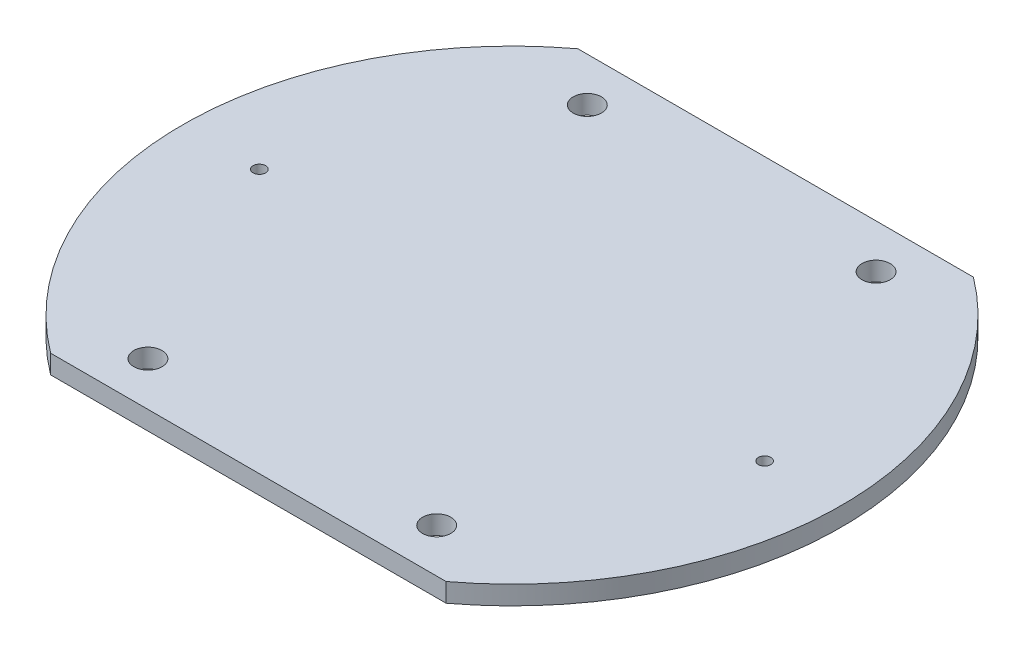
ISO-10303-21;
HEADER;
FILE_DESCRIPTION(('STEP AP214'),'2;1');
FILE_NAME('part.step','',(''),(''),'','','');
FILE_SCHEMA(('AUTOMOTIVE_DESIGN { 1 0 10303 214 1 1 1 1 }'));
ENDSEC;
DATA;
#1=APPLICATION_CONTEXT('core data for automotive mechanical design processes');
#2=APPLICATION_PROTOCOL_DEFINITION('international standard','automotive_design',2000,#1);
#3=PRODUCT_CONTEXT('',#1,'mechanical');
#4=PRODUCT('Part','Part','',(#3));
#5=PRODUCT_RELATED_PRODUCT_CATEGORY('part','',(#4));
#6=PRODUCT_DEFINITION_FORMATION('','',#4);
#7=PRODUCT_DEFINITION_CONTEXT('part definition',#1,'design');
#8=PRODUCT_DEFINITION('design','',#6,#7);
#9=PRODUCT_DEFINITION_SHAPE('','',#8);
#10=(LENGTH_UNIT() NAMED_UNIT(*) SI_UNIT(.MILLI.,.METRE.));
#11=(NAMED_UNIT(*) PLANE_ANGLE_UNIT() SI_UNIT($,.RADIAN.));
#12=(NAMED_UNIT(*) SI_UNIT($,.STERADIAN.) SOLID_ANGLE_UNIT());
#13=UNCERTAINTY_MEASURE_WITH_UNIT(LENGTH_MEASURE(1.E-05),#10,'distance_accuracy_value','');
#14=(GEOMETRIC_REPRESENTATION_CONTEXT(3) GLOBAL_UNCERTAINTY_ASSIGNED_CONTEXT((#13)) GLOBAL_UNIT_ASSIGNED_CONTEXT((#10,
#11,#12)) REPRESENTATION_CONTEXT('',''));
#15=CARTESIAN_POINT('',(0.,0.,0.));
#16=DIRECTION('',(0.,0.,1.));
#17=DIRECTION('',(1.,0.,0.));
#18=AXIS2_PLACEMENT_3D('',#15,#16,#17);
#19=CARTESIAN_POINT('',(0.,3.,0.));
#20=DIRECTION('',(0.,-1.,0.));
#21=DIRECTION('',(0.,0.,-1.));
#22=AXIS2_PLACEMENT_3D('',#19,#20,#21);
#23=CYLINDRICAL_SURFACE('',#22,52.5);
#24=CARTESIAN_POINT('',(0.,3.,0.));
#25=DIRECTION('',(0.,1.,0.));
#26=DIRECTION('',(0.,0.,1.));
#27=AXIS2_PLACEMENT_3D('',#24,#25,#26);
#28=CIRCLE('',#27,52.5);
#29=CARTESIAN_POINT('',(31.5,3.,42.));
#30=VERTEX_POINT('',#29);
#31=CARTESIAN_POINT('',(31.5,3.,-42.));
#32=VERTEX_POINT('',#31);
#33=EDGE_CURVE('E51',#30,#32,#28,.T.);
#34=ORIENTED_EDGE('',*,*,#33,.F.);
#35=DIRECTION('',(0.,1.,0.));
#36=VECTOR('',#35,1.);
#37=CARTESIAN_POINT('',(31.5,0.,42.));
#38=LINE('',#37,#36);
#39=CARTESIAN_POINT('',(31.5,0.,42.));
#40=VERTEX_POINT('',#39);
#41=EDGE_CURVE('E91',#40,#30,#38,.T.);
#42=ORIENTED_EDGE('',*,*,#41,.F.);
#43=CARTESIAN_POINT('',(0.,0.,0.));
#44=DIRECTION('',(0.,1.,0.));
#45=DIRECTION('',(0.,0.,1.));
#46=AXIS2_PLACEMENT_3D('',#43,#44,#45);
#47=CIRCLE('',#46,52.5);
#48=CARTESIAN_POINT('',(31.5,0.,-42.));
#49=VERTEX_POINT('',#48);
#50=EDGE_CURVE('E100',#40,#49,#47,.T.);
#51=ORIENTED_EDGE('',*,*,#50,.T.);
#52=DIRECTION('',(0.,1.,0.));
#53=VECTOR('',#52,1.);
#54=CARTESIAN_POINT('',(31.5,0.,-42.));
#55=LINE('',#54,#53);
#56=EDGE_CURVE('E153',#49,#32,#55,.T.);
#57=ORIENTED_EDGE('',*,*,#56,.T.);
#58=EDGE_LOOP('',(#34,#42,#51,#57));
#59=FACE_BOUND('',#58,.T.);
#60=ADVANCED_FACE('F41',(#59),#23,.T.);
#61=CARTESIAN_POINT('',(0.,3.,0.));
#62=DIRECTION('',(0.,1.,0.));
#63=DIRECTION('',(0.,0.,1.));
#64=AXIS2_PLACEMENT_3D('',#61,#62,#63);
#65=PLANE('',#64);
#66=CARTESIAN_POINT('',(-23.,3.,-35.));
#67=DIRECTION('',(0.,1.,0.));
#68=DIRECTION('',(0.,0.,1.));
#69=AXIS2_PLACEMENT_3D('',#66,#67,#68);
#70=CIRCLE('',#69,2.2479);
#71=CARTESIAN_POINT('',(-23.,3.,-32.7521));
#72=VERTEX_POINT('',#71);
#73=EDGE_CURVE('E137',#72,#72,#70,.T.);
#74=ORIENTED_EDGE('',*,*,#73,.F.);
#75=EDGE_LOOP('',(#74));
#76=FACE_BOUND('',#75,.T.);
#77=CARTESIAN_POINT('',(23.,3.,-35.));
#78=DIRECTION('',(0.,1.,0.));
#79=DIRECTION('',(0.,0.,1.));
#80=AXIS2_PLACEMENT_3D('',#77,#78,#79);
#81=CIRCLE('',#80,2.2479);
#82=CARTESIAN_POINT('',(23.,3.,-32.7521));
#83=VERTEX_POINT('',#82);
#84=EDGE_CURVE('E124',#83,#83,#81,.T.);
#85=ORIENTED_EDGE('',*,*,#84,.F.);
#86=EDGE_LOOP('',(#85));
#87=FACE_BOUND('',#86,.T.);
#88=CARTESIAN_POINT('',(23.,3.,35.));
#89=DIRECTION('',(0.,1.,0.));
#90=DIRECTION('',(0.,0.,1.));
#91=AXIS2_PLACEMENT_3D('',#88,#89,#90);
#92=CIRCLE('',#91,2.2479);
#93=CARTESIAN_POINT('',(23.,3.,37.2479));
#94=VERTEX_POINT('',#93);
#95=EDGE_CURVE('E120',#94,#94,#92,.T.);
#96=ORIENTED_EDGE('',*,*,#95,.F.);
#97=EDGE_LOOP('',(#96));
#98=FACE_BOUND('',#97,.T.);
#99=CARTESIAN_POINT('',(-23.,3.,35.));
#100=DIRECTION('',(0.,1.,0.));
#101=DIRECTION('',(0.,0.,1.));
#102=AXIS2_PLACEMENT_3D('',#99,#100,#101);
#103=CIRCLE('',#102,2.2479);
#104=CARTESIAN_POINT('',(-23.,3.,37.2479));
#105=VERTEX_POINT('',#104);
#106=EDGE_CURVE('E116',#105,#105,#103,.T.);
#107=ORIENTED_EDGE('',*,*,#106,.F.);
#108=EDGE_LOOP('',(#107));
#109=FACE_BOUND('',#108,.T.);
#110=DIRECTION('',(-1.,0.,0.));
#111=VECTOR('',#110,1.);
#112=CARTESIAN_POINT('',(-31.5,3.,42.));
#113=LINE('',#112,#111);
#114=CARTESIAN_POINT('',(-31.5,3.,42.));
#115=VERTEX_POINT('',#114);
#116=EDGE_CURVE('E59',#30,#115,#113,.T.);
#117=ORIENTED_EDGE('',*,*,#116,.F.);
#118=ORIENTED_EDGE('',*,*,#33,.T.);
#119=DIRECTION('',(1.,0.,0.));
#120=VECTOR('',#119,1.);
#121=CARTESIAN_POINT('',(-31.5,3.,-42.));
#122=LINE('',#121,#120);
#123=CARTESIAN_POINT('',(-31.5,3.,-42.));
#124=VERTEX_POINT('',#123);
#125=EDGE_CURVE('E146',#124,#32,#122,.T.);
#126=ORIENTED_EDGE('',*,*,#125,.F.);
#127=EDGE_CURVE('E11',#124,#115,#28,.T.);
#128=ORIENTED_EDGE('',*,*,#127,.T.);
#129=EDGE_LOOP('',(#117,#118,#126,#128));
#130=FACE_BOUND('',#129,.T.);
#131=CARTESIAN_POINT('',(40.25,3.,0.));
#132=DIRECTION('',(0.,1.,0.));
#133=DIRECTION('',(0.,0.,-1.));
#134=AXIS2_PLACEMENT_3D('',#131,#132,#133);
#135=CIRCLE('',#134,0.999999999999998);
#136=CARTESIAN_POINT('',(40.25,3.,-0.999999999999993));
#137=VERTEX_POINT('',#136);
#138=EDGE_CURVE('E160',#137,#137,#135,.T.);
#139=ORIENTED_EDGE('',*,*,#138,.F.);
#140=EDGE_LOOP('',(#139));
#141=FACE_BOUND('',#140,.T.);
#142=CARTESIAN_POINT('',(-40.25,3.,0.));
#143=DIRECTION('',(0.,1.,0.));
#144=DIRECTION('',(0.,0.,1.));
#145=AXIS2_PLACEMENT_3D('',#142,#143,#144);
#146=CIRCLE('',#145,0.999999999999998);
#147=CARTESIAN_POINT('',(-40.25,3.,1.));
#148=VERTEX_POINT('',#147);
#149=EDGE_CURVE('E109',#148,#148,#146,.T.);
#150=ORIENTED_EDGE('',*,*,#149,.F.);
#151=EDGE_LOOP('',(#150));
#152=FACE_BOUND('',#151,.T.);
#153=ADVANCED_FACE('F188',(#76,#87,#98,#109,#130,#141,#152),#65,.T.);
#154=CARTESIAN_POINT('',(0.,0.,0.));
#155=DIRECTION('',(0.,1.,0.));
#156=DIRECTION('',(0.,0.,1.));
#157=AXIS2_PLACEMENT_3D('',#154,#155,#156);
#158=PLANE('',#157);
#159=CARTESIAN_POINT('',(-23.,0.,-35.));
#160=DIRECTION('',(0.,1.,0.));
#161=DIRECTION('',(0.,0.,1.));
#162=AXIS2_PLACEMENT_3D('',#159,#160,#161);
#163=CIRCLE('',#162,2.2479);
#164=CARTESIAN_POINT('',(-23.,0.,-32.7521));
#165=VERTEX_POINT('',#164);
#166=EDGE_CURVE('E45',#165,#165,#163,.T.);
#167=ORIENTED_EDGE('',*,*,#166,.T.);
#168=EDGE_LOOP('',(#167));
#169=FACE_BOUND('',#168,.T.);
#170=CARTESIAN_POINT('',(23.,0.,-35.));
#171=DIRECTION('',(0.,1.,0.));
#172=DIRECTION('',(0.,0.,1.));
#173=AXIS2_PLACEMENT_3D('',#170,#171,#172);
#174=CIRCLE('',#173,2.2479);
#175=CARTESIAN_POINT('',(23.,0.,-32.7521));
#176=VERTEX_POINT('',#175);
#177=EDGE_CURVE('E121',#176,#176,#174,.T.);
#178=ORIENTED_EDGE('',*,*,#177,.T.);
#179=EDGE_LOOP('',(#178));
#180=FACE_BOUND('',#179,.T.);
#181=CARTESIAN_POINT('',(23.,0.,35.));
#182=DIRECTION('',(0.,1.,0.));
#183=DIRECTION('',(0.,0.,1.));
#184=AXIS2_PLACEMENT_3D('',#181,#182,#183);
#185=CIRCLE('',#184,2.2479);
#186=CARTESIAN_POINT('',(23.,0.,37.2479));
#187=VERTEX_POINT('',#186);
#188=EDGE_CURVE('E117',#187,#187,#185,.T.);
#189=ORIENTED_EDGE('',*,*,#188,.T.);
#190=EDGE_LOOP('',(#189));
#191=FACE_BOUND('',#190,.T.);
#192=CARTESIAN_POINT('',(-23.,0.,35.));
#193=DIRECTION('',(0.,1.,0.));
#194=DIRECTION('',(0.,0.,1.));
#195=AXIS2_PLACEMENT_3D('',#192,#193,#194);
#196=CIRCLE('',#195,2.2479);
#197=CARTESIAN_POINT('',(-23.,0.,37.2479));
#198=VERTEX_POINT('',#197);
#199=EDGE_CURVE('E112',#198,#198,#196,.T.);
#200=ORIENTED_EDGE('',*,*,#199,.T.);
#201=EDGE_LOOP('',(#200));
#202=FACE_BOUND('',#201,.T.);
#203=CARTESIAN_POINT('',(40.25,0.,0.));
#204=DIRECTION('',(0.,1.,0.));
#205=DIRECTION('',(0.,0.,-1.));
#206=AXIS2_PLACEMENT_3D('',#203,#204,#205);
#207=CIRCLE('',#206,0.999999999999998);
#208=CARTESIAN_POINT('',(40.25,0.,-0.999999999999993));
#209=VERTEX_POINT('',#208);
#210=EDGE_CURVE('E157',#209,#209,#207,.T.);
#211=ORIENTED_EDGE('',*,*,#210,.T.);
#212=EDGE_LOOP('',(#211));
#213=FACE_BOUND('',#212,.T.);
#214=ORIENTED_EDGE('',*,*,#50,.F.);
#215=DIRECTION('',(-1.,0.,0.));
#216=VECTOR('',#215,1.);
#217=CARTESIAN_POINT('',(-31.5,0.,42.));
#218=LINE('',#217,#216);
#219=CARTESIAN_POINT('',(-31.5,0.,42.));
#220=VERTEX_POINT('',#219);
#221=EDGE_CURVE('E85',#40,#220,#218,.T.);
#222=ORIENTED_EDGE('',*,*,#221,.T.);
#223=CARTESIAN_POINT('',(-31.5,0.,-42.));
#224=VERTEX_POINT('',#223);
#225=EDGE_CURVE('E99',#224,#220,#47,.T.);
#226=ORIENTED_EDGE('',*,*,#225,.F.);
#227=DIRECTION('',(1.,0.,0.));
#228=VECTOR('',#227,1.);
#229=CARTESIAN_POINT('',(-31.5,0.,-42.));
#230=LINE('',#229,#228);
#231=EDGE_CURVE('E148',#224,#49,#230,.T.);
#232=ORIENTED_EDGE('',*,*,#231,.T.);
#233=EDGE_LOOP('',(#214,#222,#226,#232));
#234=FACE_BOUND('',#233,.T.);
#235=CARTESIAN_POINT('',(-40.25,0.,0.));
#236=DIRECTION('',(0.,1.,0.));
#237=DIRECTION('',(0.,0.,1.));
#238=AXIS2_PLACEMENT_3D('',#235,#236,#237);
#239=CIRCLE('',#238,0.999999999999998);
#240=CARTESIAN_POINT('',(-40.25,0.,1.));
#241=VERTEX_POINT('',#240);
#242=EDGE_CURVE('E164',#241,#241,#239,.T.);
#243=ORIENTED_EDGE('',*,*,#242,.T.);
#244=EDGE_LOOP('',(#243));
#245=FACE_BOUND('',#244,.T.);
#246=ADVANCED_FACE('F96',(#169,#180,#191,#202,#213,#234,#245),#158,.F.);
#247=ORIENTED_EDGE('',*,*,#225,.T.);
#248=DIRECTION('',(0.,1.,0.));
#249=VECTOR('',#248,1.);
#250=CARTESIAN_POINT('',(-31.5,0.,42.));
#251=LINE('',#250,#249);
#252=EDGE_CURVE('E82',#220,#115,#251,.T.);
#253=ORIENTED_EDGE('',*,*,#252,.T.);
#254=ORIENTED_EDGE('',*,*,#127,.F.);
#255=DIRECTION('',(0.,1.,0.));
#256=VECTOR('',#255,1.);
#257=CARTESIAN_POINT('',(-31.5,0.,-42.));
#258=LINE('',#257,#256);
#259=EDGE_CURVE('E104',#224,#124,#258,.T.);
#260=ORIENTED_EDGE('',*,*,#259,.F.);
#261=EDGE_LOOP('',(#247,#253,#254,#260));
#262=FACE_BOUND('',#261,.T.);
#263=ADVANCED_FACE('F43',(#262),#23,.T.);
#264=CARTESIAN_POINT('',(-40.25,3.,0.));
#265=DIRECTION('',(0.,-1.,0.));
#266=DIRECTION('',(0.,0.,-1.));
#267=AXIS2_PLACEMENT_3D('',#264,#265,#266);
#268=CYLINDRICAL_SURFACE('',#267,0.999999999999998);
#269=ORIENTED_EDGE('',*,*,#149,.T.);
#270=EDGE_LOOP('',(#269));
#271=FACE_BOUND('',#270,.T.);
#272=ORIENTED_EDGE('',*,*,#242,.F.);
#273=EDGE_LOOP('',(#272));
#274=FACE_BOUND('',#273,.T.);
#275=ADVANCED_FACE('F174',(#271,#274),#268,.F.);
#276=CARTESIAN_POINT('',(40.25,3.,0.));
#277=DIRECTION('',(0.,-1.,0.));
#278=DIRECTION('',(0.,0.,-1.));
#279=AXIS2_PLACEMENT_3D('',#276,#277,#278);
#280=CYLINDRICAL_SURFACE('',#279,0.999999999999998);
#281=ORIENTED_EDGE('',*,*,#138,.T.);
#282=EDGE_LOOP('',(#281));
#283=FACE_BOUND('',#282,.T.);
#284=ORIENTED_EDGE('',*,*,#210,.F.);
#285=EDGE_LOOP('',(#284));
#286=FACE_BOUND('',#285,.T.);
#287=ADVANCED_FACE('F176',(#283,#286),#280,.F.);
#288=CARTESIAN_POINT('',(-31.5,0.,-42.));
#289=DIRECTION('',(0.,0.,1.));
#290=DIRECTION('',(1.,0.,0.));
#291=AXIS2_PLACEMENT_3D('',#288,#289,#290);
#292=PLANE('',#291);
#293=ORIENTED_EDGE('',*,*,#125,.T.);
#294=ORIENTED_EDGE('',*,*,#56,.F.);
#295=ORIENTED_EDGE('',*,*,#231,.F.);
#296=ORIENTED_EDGE('',*,*,#259,.T.);
#297=EDGE_LOOP('',(#293,#294,#295,#296));
#298=FACE_BOUND('',#297,.T.);
#299=ADVANCED_FACE('F183',(#298),#292,.F.);
#300=CARTESIAN_POINT('',(-31.5,0.,42.));
#301=DIRECTION('',(0.,0.,-1.));
#302=DIRECTION('',(-1.,0.,0.));
#303=AXIS2_PLACEMENT_3D('',#300,#301,#302);
#304=PLANE('',#303);
#305=ORIENTED_EDGE('',*,*,#116,.T.);
#306=ORIENTED_EDGE('',*,*,#252,.F.);
#307=ORIENTED_EDGE('',*,*,#221,.F.);
#308=ORIENTED_EDGE('',*,*,#41,.T.);
#309=EDGE_LOOP('',(#305,#306,#307,#308));
#310=FACE_BOUND('',#309,.T.);
#311=ADVANCED_FACE('F84',(#310),#304,.F.);
#312=CARTESIAN_POINT('',(-23.,3.,35.));
#313=DIRECTION('',(0.,1.,0.));
#314=DIRECTION('',(0.,0.,1.));
#315=AXIS2_PLACEMENT_3D('',#312,#313,#314);
#316=CYLINDRICAL_SURFACE('',#315,2.2479);
#317=ORIENTED_EDGE('',*,*,#106,.T.);
#318=EDGE_LOOP('',(#317));
#319=FACE_BOUND('',#318,.T.);
#320=ORIENTED_EDGE('',*,*,#199,.F.);
#321=EDGE_LOOP('',(#320));
#322=FACE_BOUND('',#321,.T.);
#323=ADVANCED_FACE('F213',(#319,#322),#316,.F.);
#324=CARTESIAN_POINT('',(23.,3.,35.));
#325=DIRECTION('',(0.,1.,0.));
#326=DIRECTION('',(0.,0.,1.));
#327=AXIS2_PLACEMENT_3D('',#324,#325,#326);
#328=CYLINDRICAL_SURFACE('',#327,2.2479);
#329=ORIENTED_EDGE('',*,*,#95,.T.);
#330=EDGE_LOOP('',(#329));
#331=FACE_BOUND('',#330,.T.);
#332=ORIENTED_EDGE('',*,*,#188,.F.);
#333=EDGE_LOOP('',(#332));
#334=FACE_BOUND('',#333,.T.);
#335=ADVANCED_FACE('F215',(#331,#334),#328,.F.);
#336=CARTESIAN_POINT('',(23.,3.,-35.));
#337=DIRECTION('',(0.,1.,0.));
#338=DIRECTION('',(0.,0.,1.));
#339=AXIS2_PLACEMENT_3D('',#336,#337,#338);
#340=CYLINDRICAL_SURFACE('',#339,2.2479);
#341=ORIENTED_EDGE('',*,*,#84,.T.);
#342=EDGE_LOOP('',(#341));
#343=FACE_BOUND('',#342,.T.);
#344=ORIENTED_EDGE('',*,*,#177,.F.);
#345=EDGE_LOOP('',(#344));
#346=FACE_BOUND('',#345,.T.);
#347=ADVANCED_FACE('F222',(#343,#346),#340,.F.);
#348=CARTESIAN_POINT('',(-23.,3.,-35.));
#349=DIRECTION('',(0.,1.,0.));
#350=DIRECTION('',(0.,0.,1.));
#351=AXIS2_PLACEMENT_3D('',#348,#349,#350);
#352=CYLINDRICAL_SURFACE('',#351,2.2479);
#353=ORIENTED_EDGE('',*,*,#73,.T.);
#354=EDGE_LOOP('',(#353));
#355=FACE_BOUND('',#354,.T.);
#356=ORIENTED_EDGE('',*,*,#166,.F.);
#357=EDGE_LOOP('',(#356));
#358=FACE_BOUND('',#357,.T.);
#359=ADVANCED_FACE('F268',(#355,#358),#352,.F.);
#360=CLOSED_SHELL('',(#60,#153,#246,#263,#275,#287,#299,#311,#323,#335,#347,#359));
#361=MANIFOLD_SOLID_BREP('B2',#360);
#362=ADVANCED_BREP_SHAPE_REPRESENTATION('',(#18,#361),#14);
#363=SHAPE_DEFINITION_REPRESENTATION(#9,#362);
ENDSEC;
END-ISO-10303-21;
